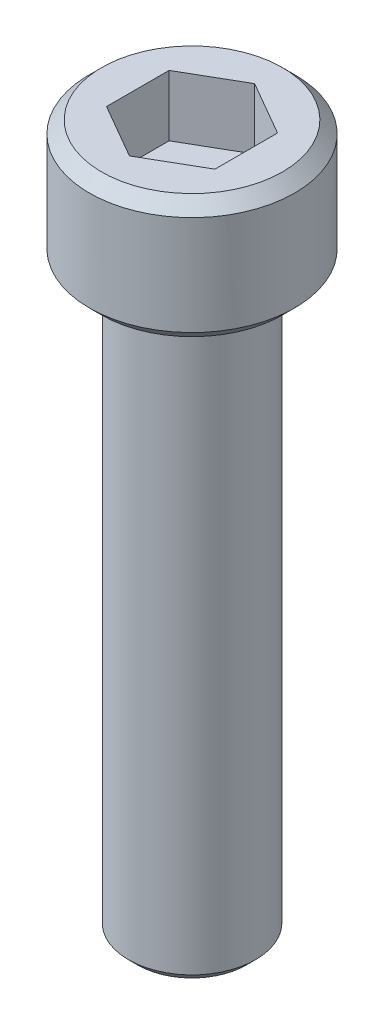
ISO-10303-21;
HEADER;
FILE_DESCRIPTION(('STEP AP214'),'2;1');
FILE_NAME('part.step','',(''),(''),'','','');
FILE_SCHEMA(('AUTOMOTIVE_DESIGN { 1 0 10303 214 1 1 1 1 }'));
ENDSEC;
DATA;
#1=APPLICATION_CONTEXT('core data for automotive mechanical design processes');
#2=APPLICATION_PROTOCOL_DEFINITION('international standard','automotive_design',2000,#1);
#3=PRODUCT_CONTEXT('',#1,'mechanical');
#4=PRODUCT('Part','Part','',(#3));
#5=PRODUCT_RELATED_PRODUCT_CATEGORY('part','',(#4));
#6=PRODUCT_DEFINITION_FORMATION('','',#4);
#7=PRODUCT_DEFINITION_CONTEXT('part definition',#1,'design');
#8=PRODUCT_DEFINITION('design','',#6,#7);
#9=PRODUCT_DEFINITION_SHAPE('','',#8);
#10=(LENGTH_UNIT() NAMED_UNIT(*) SI_UNIT(.MILLI.,.METRE.));
#11=(NAMED_UNIT(*) PLANE_ANGLE_UNIT() SI_UNIT($,.RADIAN.));
#12=(NAMED_UNIT(*) SI_UNIT($,.STERADIAN.) SOLID_ANGLE_UNIT());
#13=UNCERTAINTY_MEASURE_WITH_UNIT(LENGTH_MEASURE(1.E-05),#10,'distance_accuracy_value','');
#14=(GEOMETRIC_REPRESENTATION_CONTEXT(3) GLOBAL_UNCERTAINTY_ASSIGNED_CONTEXT((#13)) GLOBAL_UNIT_ASSIGNED_CONTEXT((#10,
#11,#12)) REPRESENTATION_CONTEXT('',''));
#15=CARTESIAN_POINT('',(0.,0.,0.));
#16=DIRECTION('',(0.,0.,1.));
#17=DIRECTION('',(1.,0.,0.));
#18=AXIS2_PLACEMENT_3D('',#15,#16,#17);
#19=CARTESIAN_POINT('',(1.778,2.064,3.07958633585746));
#20=DIRECTION('',(0.,1.,0.));
#21=DIRECTION('',(0.,0.,1.));
#22=AXIS2_PLACEMENT_3D('',#19,#20,#21);
#23=PLANE('',#22);
#24=DIRECTION('',(-0.866025403784439,0.,0.5));
#25=VECTOR('',#24,1.);
#26=CARTESIAN_POINT('',(0.,2.064,-2.05305755723831));
#27=LINE('',#26,#25);
#28=CARTESIAN_POINT('',(0.,2.064,-2.05305755723831));
#29=VERTEX_POINT('',#28);
#30=CARTESIAN_POINT('',(-1.778,2.064,-1.02652877861915));
#31=VERTEX_POINT('',#30);
#32=EDGE_CURVE('E80',#29,#31,#27,.T.);
#33=ORIENTED_EDGE('',*,*,#32,.T.);
#34=DIRECTION('',(0.,0.,1.));
#35=VECTOR('',#34,1.);
#36=CARTESIAN_POINT('',(-1.778,2.064,-1.02652877861915));
#37=LINE('',#36,#35);
#38=CARTESIAN_POINT('',(-1.778,2.064,1.02652877861916));
#39=VERTEX_POINT('',#38);
#40=EDGE_CURVE('E83',#31,#39,#37,.T.);
#41=ORIENTED_EDGE('',*,*,#40,.T.);
#42=DIRECTION('',(0.866025403784439,0.,0.499999999999999));
#43=VECTOR('',#42,1.);
#44=CARTESIAN_POINT('',(-1.778,2.064,1.02652877861916));
#45=LINE('',#44,#43);
#46=CARTESIAN_POINT('',(0.,2.064,2.05305755723831));
#47=VERTEX_POINT('',#46);
#48=EDGE_CURVE('E85',#39,#47,#45,.T.);
#49=ORIENTED_EDGE('',*,*,#48,.T.);
#50=DIRECTION('',(0.866025403784438,0.,-0.500000000000001));
#51=VECTOR('',#50,1.);
#52=CARTESIAN_POINT('',(0.,2.064,2.05305755723831));
#53=LINE('',#52,#51);
#54=CARTESIAN_POINT('',(1.778,2.064,1.02652877861915));
#55=VERTEX_POINT('',#54);
#56=EDGE_CURVE('E159',#47,#55,#53,.T.);
#57=ORIENTED_EDGE('',*,*,#56,.T.);
#58=DIRECTION('',(0.,0.,-1.));
#59=VECTOR('',#58,1.);
#60=CARTESIAN_POINT('',(1.778,2.064,1.02652877861915));
#61=LINE('',#60,#59);
#62=CARTESIAN_POINT('',(1.778,2.064,-1.02652877861916));
#63=VERTEX_POINT('',#62);
#64=EDGE_CURVE('E166',#55,#63,#61,.T.);
#65=ORIENTED_EDGE('',*,*,#64,.T.);
#66=DIRECTION('',(-0.866025403784439,0.,-0.499999999999999));
#67=VECTOR('',#66,1.);
#68=CARTESIAN_POINT('',(1.778,2.064,-1.02652877861916));
#69=LINE('',#68,#67);
#70=EDGE_CURVE('E172',#63,#29,#69,.T.);
#71=ORIENTED_EDGE('',*,*,#70,.T.);
#72=EDGE_LOOP('',(#33,#41,#49,#57,#65,#71));
#73=FACE_BOUND('',#72,.T.);
#74=ADVANCED_FACE('F16',(#73),#23,.T.);
#75=CARTESIAN_POINT('',(-1.778,2.064,1.02652877861916));
#76=DIRECTION('',(-0.499999999999999,0.,0.866025403784439));
#77=DIRECTION('',(0.866025403784439,0.,0.499999999999999));
#78=AXIS2_PLACEMENT_3D('',#75,#76,#77);
#79=PLANE('',#78);
#80=DIRECTION('',(0.,1.,0.));
#81=VECTOR('',#80,1.);
#82=CARTESIAN_POINT('',(0.,2.064,2.05305755723831));
#83=LINE('',#82,#81);
#84=CARTESIAN_POINT('',(0.,4.064,2.05305755723831));
#85=VERTEX_POINT('',#84);
#86=EDGE_CURVE('E97',#85,#47,#83,.F.);
#87=ORIENTED_EDGE('',*,*,#86,.T.);
#88=ORIENTED_EDGE('',*,*,#48,.F.);
#89=DIRECTION('',(0.,1.,0.));
#90=VECTOR('',#89,1.);
#91=CARTESIAN_POINT('',(-1.778,2.064,1.02652877861916));
#92=LINE('',#91,#90);
#93=CARTESIAN_POINT('',(-1.778,4.064,1.02652877861916));
#94=VERTEX_POINT('',#93);
#95=EDGE_CURVE('E91',#39,#94,#92,.T.);
#96=ORIENTED_EDGE('',*,*,#95,.T.);
#97=DIRECTION('',(-0.866025403784439,0.,-0.5));
#98=VECTOR('',#97,1.);
#99=CARTESIAN_POINT('',(0.,4.064,2.05305755723831));
#100=LINE('',#99,#98);
#101=EDGE_CURVE('E154',#85,#94,#100,.T.);
#102=ORIENTED_EDGE('',*,*,#101,.F.);
#103=EDGE_LOOP('',(#87,#88,#96,#102));
#104=FACE_BOUND('',#103,.T.);
#105=ADVANCED_FACE('F94',(#104),#79,.F.);
#106=CARTESIAN_POINT('',(-1.778,2.064,-1.02652877861915));
#107=DIRECTION('',(-1.,0.,0.));
#108=DIRECTION('',(0.,0.,1.));
#109=AXIS2_PLACEMENT_3D('',#106,#107,#108);
#110=PLANE('',#109);
#111=ORIENTED_EDGE('',*,*,#95,.F.);
#112=ORIENTED_EDGE('',*,*,#40,.F.);
#113=DIRECTION('',(0.,1.,0.));
#114=VECTOR('',#113,1.);
#115=CARTESIAN_POINT('',(-1.778,2.064,-1.02652877861915));
#116=LINE('',#115,#114);
#117=CARTESIAN_POINT('',(-1.778,4.064,-1.02652877861915));
#118=VERTEX_POINT('',#117);
#119=EDGE_CURVE('E111',#31,#118,#116,.T.);
#120=ORIENTED_EDGE('',*,*,#119,.T.);
#121=DIRECTION('',(0.,0.,1.));
#122=VECTOR('',#121,1.);
#123=CARTESIAN_POINT('',(-1.778,4.064,0.));
#124=LINE('',#123,#122);
#125=EDGE_CURVE('E103',#94,#118,#124,.F.);
#126=ORIENTED_EDGE('',*,*,#125,.F.);
#127=EDGE_LOOP('',(#111,#112,#120,#126));
#128=FACE_BOUND('',#127,.T.);
#129=ADVANCED_FACE('F101',(#128),#110,.F.);
#130=CARTESIAN_POINT('',(0.,2.064,-2.05305755723831));
#131=DIRECTION('',(-0.5,0.,-0.866025403784439));
#132=DIRECTION('',(-0.866025403784439,0.,0.5));
#133=AXIS2_PLACEMENT_3D('',#130,#131,#132);
#134=PLANE('',#133);
#135=ORIENTED_EDGE('',*,*,#119,.F.);
#136=ORIENTED_EDGE('',*,*,#32,.F.);
#137=DIRECTION('',(0.,1.,0.));
#138=VECTOR('',#137,1.);
#139=CARTESIAN_POINT('',(0.,2.064,-2.05305755723831));
#140=LINE('',#139,#138);
#141=CARTESIAN_POINT('',(0.,4.064,-2.05305755723831));
#142=VERTEX_POINT('',#141);
#143=EDGE_CURVE('E169',#29,#142,#140,.T.);
#144=ORIENTED_EDGE('',*,*,#143,.T.);
#145=DIRECTION('',(0.866025403784438,0.,-0.5));
#146=VECTOR('',#145,1.);
#147=CARTESIAN_POINT('',(-1.778,4.064,-1.02652877861915));
#148=LINE('',#147,#146);
#149=EDGE_CURVE('E148',#118,#142,#148,.T.);
#150=ORIENTED_EDGE('',*,*,#149,.F.);
#151=EDGE_LOOP('',(#135,#136,#144,#150));
#152=FACE_BOUND('',#151,.T.);
#153=ADVANCED_FACE('F176',(#152),#134,.F.);
#154=CARTESIAN_POINT('',(1.778,2.064,-1.02652877861916));
#155=DIRECTION('',(0.499999999999999,0.,-0.866025403784439));
#156=DIRECTION('',(-0.866025403784439,0.,-0.499999999999999));
#157=AXIS2_PLACEMENT_3D('',#154,#155,#156);
#158=PLANE('',#157);
#159=ORIENTED_EDGE('',*,*,#143,.F.);
#160=ORIENTED_EDGE('',*,*,#70,.F.);
#161=DIRECTION('',(0.,1.,0.));
#162=VECTOR('',#161,1.);
#163=CARTESIAN_POINT('',(1.778,2.064,-1.02652877861916));
#164=LINE('',#163,#162);
#165=CARTESIAN_POINT('',(1.778,4.064,-1.02652877861916));
#166=VERTEX_POINT('',#165);
#167=EDGE_CURVE('E163',#63,#166,#164,.T.);
#168=ORIENTED_EDGE('',*,*,#167,.T.);
#169=DIRECTION('',(0.866025403784439,0.,0.5));
#170=VECTOR('',#169,1.);
#171=CARTESIAN_POINT('',(0.,4.064,-2.05305755723831));
#172=LINE('',#171,#170);
#173=EDGE_CURVE('E144',#142,#166,#172,.T.);
#174=ORIENTED_EDGE('',*,*,#173,.F.);
#175=EDGE_LOOP('',(#159,#160,#168,#174));
#176=FACE_BOUND('',#175,.T.);
#177=ADVANCED_FACE('F188',(#176),#158,.F.);
#178=CARTESIAN_POINT('',(1.778,2.064,1.02652877861915));
#179=DIRECTION('',(1.,0.,0.));
#180=DIRECTION('',(0.,0.,-1.));
#181=AXIS2_PLACEMENT_3D('',#178,#179,#180);
#182=PLANE('',#181);
#183=ORIENTED_EDGE('',*,*,#167,.F.);
#184=ORIENTED_EDGE('',*,*,#64,.F.);
#185=DIRECTION('',(0.,1.,0.));
#186=VECTOR('',#185,1.);
#187=CARTESIAN_POINT('',(1.778,2.064,1.02652877861915));
#188=LINE('',#187,#186);
#189=CARTESIAN_POINT('',(1.778,4.064,1.02652877861915));
#190=VERTEX_POINT('',#189);
#191=EDGE_CURVE('E39',#55,#190,#188,.T.);
#192=ORIENTED_EDGE('',*,*,#191,.T.);
#193=DIRECTION('',(0.,0.,1.));
#194=VECTOR('',#193,1.);
#195=CARTESIAN_POINT('',(1.778,4.064,0.));
#196=LINE('',#195,#194);
#197=EDGE_CURVE('E140',#166,#190,#196,.T.);
#198=ORIENTED_EDGE('',*,*,#197,.F.);
#199=EDGE_LOOP('',(#183,#184,#192,#198));
#200=FACE_BOUND('',#199,.T.);
#201=ADVANCED_FACE('F186',(#200),#182,.F.);
#202=CARTESIAN_POINT('',(0.,2.064,2.05305755723831));
#203=DIRECTION('',(0.500000000000001,0.,0.866025403784438));
#204=DIRECTION('',(0.866025403784438,0.,-0.500000000000001));
#205=AXIS2_PLACEMENT_3D('',#202,#203,#204);
#206=PLANE('',#205);
#207=ORIENTED_EDGE('',*,*,#191,.F.);
#208=ORIENTED_EDGE('',*,*,#56,.F.);
#209=ORIENTED_EDGE('',*,*,#86,.F.);
#210=DIRECTION('',(-0.866025403784438,0.,0.500000000000001));
#211=VECTOR('',#210,1.);
#212=CARTESIAN_POINT('',(1.778,4.064,1.02652877861915));
#213=LINE('',#212,#211);
#214=EDGE_CURVE('E136',#190,#85,#213,.T.);
#215=ORIENTED_EDGE('',*,*,#214,.F.);
#216=EDGE_LOOP('',(#207,#208,#209,#215));
#217=FACE_BOUND('',#216,.T.);
#218=ADVANCED_FACE('F183',(#217),#206,.F.);
#219=CARTESIAN_POINT('',(0.,4.064,0.));
#220=DIRECTION('',(0.,1.,0.));
#221=DIRECTION('',(0.,0.,1.));
#222=AXIS2_PLACEMENT_3D('',#219,#220,#221);
#223=PLANE('',#222);
#224=ORIENTED_EDGE('',*,*,#197,.T.);
#225=ORIENTED_EDGE('',*,*,#214,.T.);
#226=ORIENTED_EDGE('',*,*,#101,.T.);
#227=ORIENTED_EDGE('',*,*,#125,.T.);
#228=ORIENTED_EDGE('',*,*,#149,.T.);
#229=ORIENTED_EDGE('',*,*,#173,.T.);
#230=EDGE_LOOP('',(#224,#225,#226,#227,#228,#229));
#231=FACE_BOUND('',#230,.T.);
#232=CARTESIAN_POINT('',(0.,4.06400000002805,0.));
#233=DIRECTION('',(0.,-1.,0.));
#234=DIRECTION('',(1.,0.,0.));
#235=AXIS2_PLACEMENT_3D('',#232,#233,#234);
#236=CIRCLE('',#235,2.96550000007301);
#237=CARTESIAN_POINT('',(2.96550000007301,4.06400000002805,0.));
#238=VERTEX_POINT('',#237);
#239=EDGE_CURVE('E19',#238,#238,#236,.T.);
#240=ORIENTED_EDGE('',*,*,#239,.F.);
#241=EDGE_LOOP('',(#240));
#242=FACE_BOUND('',#241,.T.);
#243=ADVANCED_FACE('F180',(#231,#242),#223,.T.);
#244=CARTESIAN_POINT('',(0.,3.66400000007161,0.));
#245=DIRECTION('',(0.,-1.,0.));
#246=DIRECTION('',(1.,0.,0.));
#247=AXIS2_PLACEMENT_3D('',#244,#245,#246);
#248=CONICAL_SURFACE('',#247,3.36550000002944,0.785398163397448);
#249=ORIENTED_EDGE('',*,*,#239,.T.);
#250=EDGE_LOOP('',(#249));
#251=FACE_BOUND('',#250,.T.);
#252=CARTESIAN_POINT('',(0.,3.664,0.));
#253=DIRECTION('',(0.,-1.,0.));
#254=DIRECTION('',(0.,0.,-1.));
#255=AXIS2_PLACEMENT_3D('',#252,#253,#254);
#256=CIRCLE('',#255,3.3655);
#257=CARTESIAN_POINT('',(0.,3.664,-3.3655));
#258=VERTEX_POINT('',#257);
#259=EDGE_CURVE('E127',#258,#258,#256,.T.);
#260=ORIENTED_EDGE('',*,*,#259,.F.);
#261=EDGE_LOOP('',(#260));
#262=FACE_BOUND('',#261,.T.);
#263=ADVANCED_FACE('F225',(#251,#262),#248,.T.);
#264=CARTESIAN_POINT('',(0.,4.064,0.));
#265=DIRECTION('',(0.,-1.,0.));
#266=DIRECTION('',(0.,0.,-1.));
#267=AXIS2_PLACEMENT_3D('',#264,#265,#266);
#268=CYLINDRICAL_SURFACE('',#267,3.3655);
#269=ORIENTED_EDGE('',*,*,#259,.T.);
#270=EDGE_LOOP('',(#269));
#271=FACE_BOUND('',#270,.T.);
#272=CARTESIAN_POINT('',(0.,0.400000000013279,0.));
#273=DIRECTION('',(0.,1.,0.));
#274=DIRECTION('',(0.,0.,1.));
#275=AXIS2_PLACEMENT_3D('',#272,#273,#274);
#276=CIRCLE('',#275,3.36549999991576);
#277=CARTESIAN_POINT('',(0.,0.400000000013279,3.36549999991576));
#278=VERTEX_POINT('',#277);
#279=EDGE_CURVE('E121',#278,#278,#276,.F.);
#280=ORIENTED_EDGE('',*,*,#279,.F.);
#281=EDGE_LOOP('',(#280));
#282=FACE_BOUND('',#281,.T.);
#283=ADVANCED_FACE('F221',(#271,#282),#268,.T.);
#284=CARTESIAN_POINT('',(0.,-19.05,0.));
#285=DIRECTION('',(0.,1.,0.));
#286=DIRECTION('',(0.,0.,1.));
#287=AXIS2_PLACEMENT_3D('',#284,#285,#286);
#288=PLANE('',#287);
#289=CARTESIAN_POINT('',(0.,-19.0499999999929,0.));
#290=DIRECTION('',(0.,1.,0.));
#291=DIRECTION('',(0.,0.,1.));
#292=AXIS2_PLACEMENT_3D('',#289,#290,#291);
#293=CIRCLE('',#292,1.78279999994402);
#294=CARTESIAN_POINT('',(0.,-19.0499999999929,1.78279999994402));
#295=VERTEX_POINT('',#294);
#296=EDGE_CURVE('E118',#295,#295,#293,.T.);
#297=ORIENTED_EDGE('',*,*,#296,.F.);
#298=EDGE_LOOP('',(#297));
#299=FACE_BOUND('',#298,.T.);
#300=ADVANCED_FACE('F217',(#299),#288,.F.);
#301=CARTESIAN_POINT('',(0.,0.400000000013279,0.));
#302=DIRECTION('',(0.,1.,0.));
#303=DIRECTION('',(0.,0.,1.));
#304=AXIS2_PLACEMENT_3D('',#301,#302,#303);
#305=CONICAL_SURFACE('',#304,3.36549999991576,0.785398163326394);
#306=CARTESIAN_POINT('',(0.,5.6843418860808E-11,0.));
#307=DIRECTION('',(0.,1.,0.));
#308=DIRECTION('',(0.,0.,1.));
#309=AXIS2_PLACEMENT_3D('',#306,#307,#308);
#310=CIRCLE('',#309,2.96550000001616);
#311=CARTESIAN_POINT('',(0.,5.6843418860808E-11,2.96550000001616));
#312=VERTEX_POINT('',#311);
#313=EDGE_CURVE('E115',#312,#312,#310,.T.);
#314=ORIENTED_EDGE('',*,*,#313,.T.);
#315=EDGE_LOOP('',(#314));
#316=FACE_BOUND('',#315,.T.);
#317=ORIENTED_EDGE('',*,*,#279,.T.);
#318=EDGE_LOOP('',(#317));
#319=FACE_BOUND('',#318,.T.);
#320=ADVANCED_FACE('F213',(#316,#319),#305,.T.);
#321=CARTESIAN_POINT('',(0.,-18.7500000000114,0.));
#322=DIRECTION('',(0.,1.,0.));
#323=DIRECTION('',(0.,0.,1.));
#324=AXIS2_PLACEMENT_3D('',#321,#322,#323);
#325=CONICAL_SURFACE('',#324,2.08279999992556,0.785398163397448);
#326=CARTESIAN_POINT('',(0.,-18.75,0.));
#327=DIRECTION('',(0.,1.,0.));
#328=DIRECTION('',(0.,0.,1.));
#329=AXIS2_PLACEMENT_3D('',#326,#327,#328);
#330=CIRCLE('',#329,2.0828);
#331=CARTESIAN_POINT('',(0.,-18.75,2.0828));
#332=VERTEX_POINT('',#331);
#333=EDGE_CURVE('E26',#332,#332,#330,.T.);
#334=ORIENTED_EDGE('',*,*,#333,.F.);
#335=EDGE_LOOP('',(#334));
#336=FACE_BOUND('',#335,.T.);
#337=ORIENTED_EDGE('',*,*,#296,.T.);
#338=EDGE_LOOP('',(#337));
#339=FACE_BOUND('',#338,.T.);
#340=ADVANCED_FACE('F206',(#336,#339),#325,.T.);
#341=CARTESIAN_POINT('',(0.,0.,0.));
#342=DIRECTION('',(0.,1.,0.));
#343=DIRECTION('',(0.,0.,1.));
#344=AXIS2_PLACEMENT_3D('',#341,#342,#343);
#345=PLANE('',#344);
#346=CARTESIAN_POINT('',(0.,0.,0.));
#347=DIRECTION('',(0.,1.,0.));
#348=DIRECTION('',(0.,0.,1.));
#349=AXIS2_PLACEMENT_3D('',#346,#347,#348);
#350=CIRCLE('',#349,2.0828);
#351=CARTESIAN_POINT('',(0.,0.,2.0828));
#352=VERTEX_POINT('',#351);
#353=EDGE_CURVE('E11',#352,#352,#350,.F.);
#354=ORIENTED_EDGE('',*,*,#353,.F.);
#355=EDGE_LOOP('',(#354));
#356=FACE_BOUND('',#355,.T.);
#357=ORIENTED_EDGE('',*,*,#313,.F.);
#358=EDGE_LOOP('',(#357));
#359=FACE_BOUND('',#358,.T.);
#360=ADVANCED_FACE('F200',(#356,#359),#345,.F.);
#361=CARTESIAN_POINT('',(0.,-19.05,0.));
#362=DIRECTION('',(0.,1.,0.));
#363=DIRECTION('',(0.,0.,1.));
#364=AXIS2_PLACEMENT_3D('',#361,#362,#363);
#365=CYLINDRICAL_SURFACE('',#364,2.0828);
#366=ORIENTED_EDGE('',*,*,#353,.T.);
#367=EDGE_LOOP('',(#366));
#368=FACE_BOUND('',#367,.T.);
#369=ORIENTED_EDGE('',*,*,#333,.T.);
#370=EDGE_LOOP('',(#369));
#371=FACE_BOUND('',#370,.T.);
#372=ADVANCED_FACE('F198',(#368,#371),#365,.T.);
#373=CLOSED_SHELL('',(#74,#105,#129,#153,#177,#201,#218,#243,#263,#283,#300,#320,#340,#360,#372));
#374=MANIFOLD_SOLID_BREP('B1',#373);
#375=ADVANCED_BREP_SHAPE_REPRESENTATION('',(#18,#374),#14);
#376=SHAPE_DEFINITION_REPRESENTATION(#9,#375);
ENDSEC;
END-ISO-10303-21;
